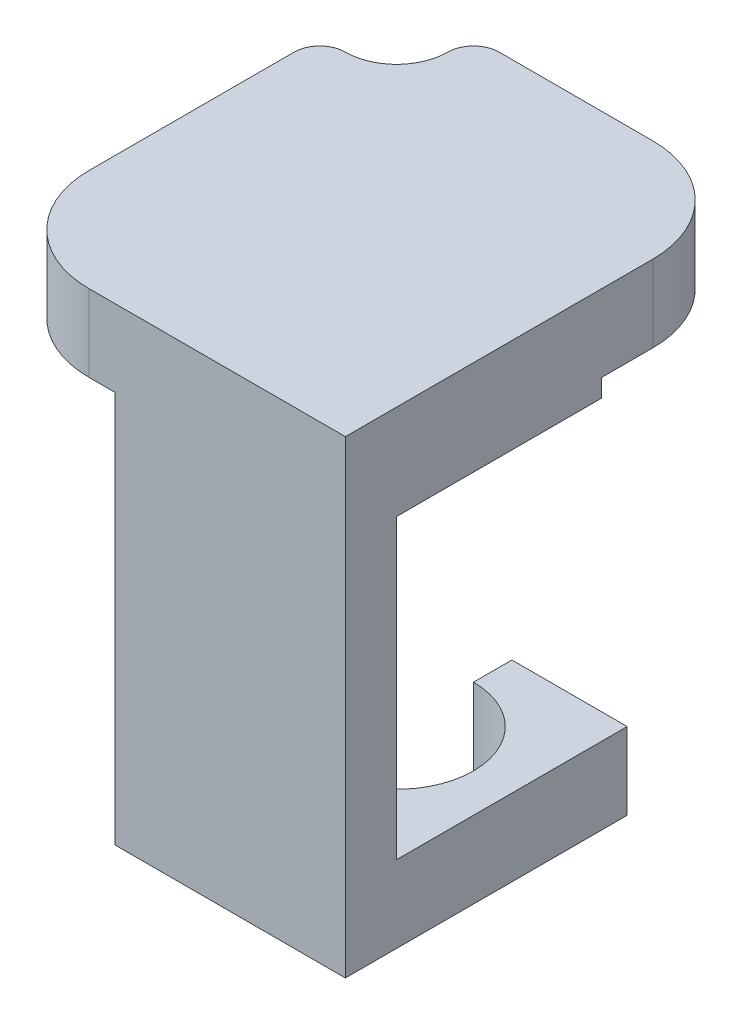
ISO-10303-21;
HEADER;
FILE_DESCRIPTION(('STEP AP214'),'2;1');
FILE_NAME('part.step','',(''),(''),'','','');
FILE_SCHEMA(('AUTOMOTIVE_DESIGN { 1 0 10303 214 1 1 1 1 }'));
ENDSEC;
DATA;
#1=APPLICATION_CONTEXT('core data for automotive mechanical design processes');
#2=APPLICATION_PROTOCOL_DEFINITION('international standard','automotive_design',2000,#1);
#3=PRODUCT_CONTEXT('',#1,'mechanical');
#4=PRODUCT('Part','Part','',(#3));
#5=PRODUCT_RELATED_PRODUCT_CATEGORY('part','',(#4));
#6=PRODUCT_DEFINITION_FORMATION('','',#4);
#7=PRODUCT_DEFINITION_CONTEXT('part definition',#1,'design');
#8=PRODUCT_DEFINITION('design','',#6,#7);
#9=PRODUCT_DEFINITION_SHAPE('','',#8);
#10=(LENGTH_UNIT() NAMED_UNIT(*) SI_UNIT(.MILLI.,.METRE.));
#11=(NAMED_UNIT(*) PLANE_ANGLE_UNIT() SI_UNIT($,.RADIAN.));
#12=(NAMED_UNIT(*) SI_UNIT($,.STERADIAN.) SOLID_ANGLE_UNIT());
#13=UNCERTAINTY_MEASURE_WITH_UNIT(LENGTH_MEASURE(1.E-05),#10,'distance_accuracy_value','');
#14=(GEOMETRIC_REPRESENTATION_CONTEXT(3) GLOBAL_UNCERTAINTY_ASSIGNED_CONTEXT((#13)) GLOBAL_UNIT_ASSIGNED_CONTEXT((#10,
#11,#12)) REPRESENTATION_CONTEXT('',''));
#15=CARTESIAN_POINT('',(0.,0.,0.));
#16=DIRECTION('',(0.,0.,1.));
#17=DIRECTION('',(1.,0.,0.));
#18=AXIS2_PLACEMENT_3D('',#15,#16,#17);
#19=CARTESIAN_POINT('',(0.,0.,-5.28410471378163));
#20=DIRECTION('',(0.,0.,-1.));
#21=DIRECTION('',(-1.,0.,0.));
#22=AXIS2_PLACEMENT_3D('',#19,#20,#21);
#23=PLANE('',#22);
#24=DIRECTION('',(0.,-1.,0.));
#25=VECTOR('',#24,1.);
#26=CARTESIAN_POINT('',(-13.3528439453228,-3.,-5.28410471378163));
#27=LINE('',#26,#25);
#28=CARTESIAN_POINT('',(-13.3528439453228,11.5999999999993,-5.28410471378163));
#29=VERTEX_POINT('',#28);
#30=CARTESIAN_POINT('',(-13.3528439453228,0.,-5.28410471378163));
#31=VERTEX_POINT('',#30);
#32=EDGE_CURVE('E243',#29,#31,#27,.T.);
#33=ORIENTED_EDGE('',*,*,#32,.F.);
#34=DIRECTION('',(-1.,0.,0.));
#35=VECTOR('',#34,1.);
#36=CARTESIAN_POINT('',(-4.35284394532278,11.5999999999993,-5.28410471378163));
#37=LINE('',#36,#35);
#38=CARTESIAN_POINT('',(-4.35284394532278,11.5999999999993,-5.28410471378163));
#39=VERTEX_POINT('',#38);
#40=EDGE_CURVE('E220',#39,#29,#37,.T.);
#41=ORIENTED_EDGE('',*,*,#40,.F.);
#42=DIRECTION('',(0.,1.,0.));
#43=VECTOR('',#42,1.);
#44=CARTESIAN_POINT('',(-4.35284394532278,-3.,-5.28410471378163));
#45=LINE('',#44,#43);
#46=CARTESIAN_POINT('',(-4.35284394532278,0.,-5.28410471378163));
#47=VERTEX_POINT('',#46);
#48=EDGE_CURVE('E247',#47,#39,#45,.T.);
#49=ORIENTED_EDGE('',*,*,#48,.F.);
#50=DIRECTION('',(1.,0.,0.));
#51=VECTOR('',#50,1.);
#52=CARTESIAN_POINT('',(-13.3528439453228,0.,-5.28410471378163));
#53=LINE('',#52,#51);
#54=EDGE_CURVE('E443',#31,#47,#53,.T.);
#55=ORIENTED_EDGE('',*,*,#54,.F.);
#56=EDGE_LOOP('',(#33,#41,#49,#55));
#57=FACE_BOUND('',#56,.T.);
#58=ADVANCED_FACE('F39',(#57),#23,.T.);
#59=CARTESIAN_POINT('',(-4.35284394532278,-3.,-14.2841047137816));
#60=DIRECTION('',(1.,0.,0.));
#61=DIRECTION('',(0.,0.,-1.));
#62=AXIS2_PLACEMENT_3D('',#59,#60,#61);
#63=PLANE('',#62);
#64=DIRECTION('',(0.,0.,-1.));
#65=VECTOR('',#64,1.);
#66=CARTESIAN_POINT('',(-4.35284394532278,12.3,-19.2841047137816));
#67=LINE('',#66,#65);
#68=CARTESIAN_POINT('',(-4.35284394532278,12.3,-13.2841047137816));
#69=VERTEX_POINT('',#68);
#70=CARTESIAN_POINT('',(-4.35284394532278,12.3,-15.2841047137816));
#71=VERTEX_POINT('',#70);
#72=EDGE_CURVE('E531',#69,#71,#67,.T.);
#73=ORIENTED_EDGE('',*,*,#72,.T.);
#74=DIRECTION('',(0.,1.,0.));
#75=VECTOR('',#74,1.);
#76=CARTESIAN_POINT('',(-4.35284394532278,-3.,-15.2841047137816));
#77=LINE('',#76,#75);
#78=CARTESIAN_POINT('',(-4.35284394532278,15.3,-15.2841047137816));
#79=VERTEX_POINT('',#78);
#80=EDGE_CURVE('E267',#71,#79,#77,.T.);
#81=ORIENTED_EDGE('',*,*,#80,.T.);
#82=DIRECTION('',(0.,0.,-1.));
#83=VECTOR('',#82,1.);
#84=CARTESIAN_POINT('',(-4.35284394532278,15.3,-3.28410471378163));
#85=LINE('',#84,#83);
#86=CARTESIAN_POINT('',(-4.35284394532278,15.3,-3.28410471378163));
#87=VERTEX_POINT('',#86);
#88=EDGE_CURVE('E255',#87,#79,#85,.T.);
#89=ORIENTED_EDGE('',*,*,#88,.F.);
#90=DIRECTION('',(0.,1.,0.));
#91=VECTOR('',#90,1.);
#92=CARTESIAN_POINT('',(-4.35284394532278,-3.,-3.28410471378163));
#93=LINE('',#92,#91);
#94=CARTESIAN_POINT('',(-4.35284394532278,-3.,-3.28410471378163));
#95=VERTEX_POINT('',#94);
#96=EDGE_CURVE('E250',#95,#87,#93,.T.);
#97=ORIENTED_EDGE('',*,*,#96,.F.);
#98=DIRECTION('',(0.,0.,-1.));
#99=VECTOR('',#98,1.);
#100=CARTESIAN_POINT('',(-4.35284394532278,-3.,-14.2841047137816));
#101=LINE('',#100,#99);
#102=CARTESIAN_POINT('',(-4.35284394532278,-3.,-14.2841047137816));
#103=VERTEX_POINT('',#102);
#104=EDGE_CURVE('E489',#95,#103,#101,.T.);
#105=ORIENTED_EDGE('',*,*,#104,.T.);
#106=DIRECTION('',(0.,1.,0.));
#107=VECTOR('',#106,1.);
#108=CARTESIAN_POINT('',(-4.35284394532278,-3.,-14.2841047137816));
#109=LINE('',#108,#107);
#110=CARTESIAN_POINT('',(-4.35284394532278,0.,-14.2841047137816));
#111=VERTEX_POINT('',#110);
#112=EDGE_CURVE('E268',#103,#111,#109,.T.);
#113=ORIENTED_EDGE('',*,*,#112,.T.);
#114=DIRECTION('',(0.,0.,-1.));
#115=VECTOR('',#114,1.);
#116=CARTESIAN_POINT('',(-4.35284394532278,0.,-14.2841047137816));
#117=LINE('',#116,#115);
#118=EDGE_CURVE('E456',#47,#111,#117,.T.);
#119=ORIENTED_EDGE('',*,*,#118,.F.);
#120=ORIENTED_EDGE('',*,*,#48,.T.);
#121=DIRECTION('',(0.,0.,1.));
#122=VECTOR('',#121,1.);
#123=CARTESIAN_POINT('',(-4.35284394532278,11.5999999999993,-13.2841047137816));
#124=LINE('',#123,#122);
#125=CARTESIAN_POINT('',(-4.35284394532278,11.5999999999993,-13.2841047137816));
#126=VERTEX_POINT('',#125);
#127=EDGE_CURVE('E241',#126,#39,#124,.T.);
#128=ORIENTED_EDGE('',*,*,#127,.F.);
#129=DIRECTION('',(0.,-1.,0.));
#130=VECTOR('',#129,1.);
#131=CARTESIAN_POINT('',(-4.35284394532278,15.3,-13.2841047137816));
#132=LINE('',#131,#130);
#133=EDGE_CURVE('E230',#69,#126,#132,.T.);
#134=ORIENTED_EDGE('',*,*,#133,.F.);
#135=EDGE_LOOP('',(#73,#81,#89,#97,#105,#113,#119,#120,#128,#134));
#136=FACE_BOUND('',#135,.T.);
#137=ADVANCED_FACE('F340',(#136),#63,.T.);
#138=CARTESIAN_POINT('',(-13.3528439453228,-3.,-14.2841047137816));
#139=DIRECTION('',(-1.,0.,0.));
#140=DIRECTION('',(0.,0.,1.));
#141=AXIS2_PLACEMENT_3D('',#138,#139,#140);
#142=PLANE('',#141);
#143=DIRECTION('',(0.,0.,1.));
#144=VECTOR('',#143,1.);
#145=CARTESIAN_POINT('',(-13.3528439453228,12.3,-14.2841047137816));
#146=LINE('',#145,#144);
#147=CARTESIAN_POINT('',(-13.3528439453228,12.3,-13.2841047137816));
#148=VERTEX_POINT('',#147);
#149=CARTESIAN_POINT('',(-13.3528439453228,12.3,-3.28410471378163));
#150=VERTEX_POINT('',#149);
#151=EDGE_CURVE('E216',#148,#150,#146,.T.);
#152=ORIENTED_EDGE('',*,*,#151,.F.);
#153=DIRECTION('',(0.,-1.,0.));
#154=VECTOR('',#153,1.);
#155=CARTESIAN_POINT('',(-13.3528439453228,15.3,-13.2841047137816));
#156=LINE('',#155,#154);
#157=CARTESIAN_POINT('',(-13.3528439453228,11.5999999999993,-13.2841047137816));
#158=VERTEX_POINT('',#157);
#159=EDGE_CURVE('E235',#148,#158,#156,.T.);
#160=ORIENTED_EDGE('',*,*,#159,.T.);
#161=DIRECTION('',(0.,0.,1.));
#162=VECTOR('',#161,1.);
#163=CARTESIAN_POINT('',(-13.3528439453228,11.5999999999993,-13.2841047137816));
#164=LINE('',#163,#162);
#165=EDGE_CURVE('E237',#158,#29,#164,.T.);
#166=ORIENTED_EDGE('',*,*,#165,.T.);
#167=ORIENTED_EDGE('',*,*,#32,.T.);
#168=DIRECTION('',(0.,0.,1.));
#169=VECTOR('',#168,1.);
#170=CARTESIAN_POINT('',(-13.3528439453228,0.,-14.2841047137816));
#171=LINE('',#170,#169);
#172=CARTESIAN_POINT('',(-13.3528439453228,0.,-9.78410471378163));
#173=VERTEX_POINT('',#172);
#174=EDGE_CURVE('E448',#173,#31,#171,.T.);
#175=ORIENTED_EDGE('',*,*,#174,.F.);
#176=DIRECTION('',(0.,-1.,0.));
#177=VECTOR('',#176,1.);
#178=CARTESIAN_POINT('',(-13.3528439453228,0.,-9.78410471378163));
#179=LINE('',#178,#177);
#180=CARTESIAN_POINT('',(-13.3528439453228,-3.,-9.78410471378163));
#181=VERTEX_POINT('',#180);
#182=EDGE_CURVE('E486',#173,#181,#179,.T.);
#183=ORIENTED_EDGE('',*,*,#182,.T.);
#184=DIRECTION('',(0.,0.,1.));
#185=VECTOR('',#184,1.);
#186=CARTESIAN_POINT('',(-13.3528439453228,-3.,-14.2841047137816));
#187=LINE('',#186,#185);
#188=CARTESIAN_POINT('',(-13.3528439453228,-3.,-3.28410471378163));
#189=VERTEX_POINT('',#188);
#190=EDGE_CURVE('E496',#181,#189,#187,.T.);
#191=ORIENTED_EDGE('',*,*,#190,.T.);
#192=DIRECTION('',(0.,-1.,0.));
#193=VECTOR('',#192,1.);
#194=CARTESIAN_POINT('',(-13.3528439453228,-3.,-3.28410471378163));
#195=LINE('',#194,#193);
#196=EDGE_CURVE('E244',#150,#189,#195,.T.);
#197=ORIENTED_EDGE('',*,*,#196,.F.);
#198=EDGE_LOOP('',(#152,#160,#166,#167,#175,#183,#191,#197));
#199=FACE_BOUND('',#198,.T.);
#200=ADVANCED_FACE('F346',(#199),#142,.T.);
#201=CARTESIAN_POINT('',(-13.3528439453228,-3.,-14.2841047137816));
#202=DIRECTION('',(0.,0.,-1.));
#203=DIRECTION('',(-1.,0.,0.));
#204=AXIS2_PLACEMENT_3D('',#201,#202,#203);
#205=PLANE('',#204);
#206=DIRECTION('',(0.,-1.,0.));
#207=VECTOR('',#206,1.);
#208=CARTESIAN_POINT('',(-8.85284394532278,0.,-14.2841047137816));
#209=LINE('',#208,#207);
#210=CARTESIAN_POINT('',(-8.85284394532278,0.,-14.2841047137816));
#211=VERTEX_POINT('',#210);
#212=CARTESIAN_POINT('',(-8.85284394532278,-3.,-14.2841047137816));
#213=VERTEX_POINT('',#212);
#214=EDGE_CURVE('E483',#211,#213,#209,.T.);
#215=ORIENTED_EDGE('',*,*,#214,.F.);
#216=DIRECTION('',(-1.,0.,0.));
#217=VECTOR('',#216,1.);
#218=CARTESIAN_POINT('',(-13.3528439453228,0.,-14.2841047137816));
#219=LINE('',#218,#217);
#220=EDGE_CURVE('E499',#111,#211,#219,.T.);
#221=ORIENTED_EDGE('',*,*,#220,.F.);
#222=ORIENTED_EDGE('',*,*,#112,.F.);
#223=DIRECTION('',(-1.,0.,0.));
#224=VECTOR('',#223,1.);
#225=CARTESIAN_POINT('',(-13.3528439453228,-3.,-14.2841047137816));
#226=LINE('',#225,#224);
#227=EDGE_CURVE('E492',#103,#213,#226,.T.);
#228=ORIENTED_EDGE('',*,*,#227,.T.);
#229=EDGE_LOOP('',(#215,#221,#222,#228));
#230=FACE_BOUND('',#229,.T.);
#231=ADVANCED_FACE('F372',(#230),#205,.T.);
#232=CARTESIAN_POINT('',(0.,-3.,0.));
#233=DIRECTION('',(0.,1.,0.));
#234=DIRECTION('',(0.,0.,1.));
#235=AXIS2_PLACEMENT_3D('',#232,#233,#234);
#236=PLANE('',#235);
#237=CARTESIAN_POINT('',(-8.85284394532278,-3.,-9.78410471378163));
#238=DIRECTION('',(0.,-1.,0.));
#239=DIRECTION('',(0.,0.,-1.));
#240=AXIS2_PLACEMENT_3D('',#237,#238,#239);
#241=CIRCLE('',#240,3.);
#242=CARTESIAN_POINT('',(-8.85284394532278,-3.,-12.7841047137816));
#243=VERTEX_POINT('',#242);
#244=CARTESIAN_POINT('',(-11.8528439453228,-3.,-9.78410471378163));
#245=VERTEX_POINT('',#244);
#246=EDGE_CURVE('E471',#243,#245,#241,.T.);
#247=ORIENTED_EDGE('',*,*,#246,.F.);
#248=DIRECTION('',(0.,0.,1.));
#249=VECTOR('',#248,1.);
#250=CARTESIAN_POINT('',(-8.85284394532278,-3.,-12.7841047137816));
#251=LINE('',#250,#249);
#252=EDGE_CURVE('E463',#213,#243,#251,.T.);
#253=ORIENTED_EDGE('',*,*,#252,.F.);
#254=ORIENTED_EDGE('',*,*,#227,.F.);
#255=ORIENTED_EDGE('',*,*,#104,.F.);
#256=DIRECTION('',(1.,0.,0.));
#257=VECTOR('',#256,1.);
#258=CARTESIAN_POINT('',(-13.3528439453228,-3.,-3.28410471378163));
#259=LINE('',#258,#257);
#260=EDGE_CURVE('E246',#189,#95,#259,.T.);
#261=ORIENTED_EDGE('',*,*,#260,.F.);
#262=ORIENTED_EDGE('',*,*,#190,.F.);
#263=DIRECTION('',(-1.,0.,0.));
#264=VECTOR('',#263,1.);
#265=CARTESIAN_POINT('',(-13.3528439453228,-3.,-9.78410471378163));
#266=LINE('',#265,#264);
#267=EDGE_CURVE('E475',#245,#181,#266,.T.);
#268=ORIENTED_EDGE('',*,*,#267,.F.);
#269=EDGE_LOOP('',(#247,#253,#254,#255,#261,#262,#268));
#270=FACE_BOUND('',#269,.T.);
#271=ADVANCED_FACE('F369',(#270),#236,.F.);
#272=CARTESIAN_POINT('',(0.,0.,0.));
#273=DIRECTION('',(0.,1.,0.));
#274=DIRECTION('',(0.,0.,1.));
#275=AXIS2_PLACEMENT_3D('',#272,#273,#274);
#276=PLANE('',#275);
#277=DIRECTION('',(0.,0.,1.));
#278=VECTOR('',#277,1.);
#279=CARTESIAN_POINT('',(-8.85284394532278,0.,-12.7841047137816));
#280=LINE('',#279,#278);
#281=CARTESIAN_POINT('',(-8.85284394532278,0.,-12.7841047137816));
#282=VERTEX_POINT('',#281);
#283=EDGE_CURVE('E466',#211,#282,#280,.T.);
#284=ORIENTED_EDGE('',*,*,#283,.T.);
#285=CARTESIAN_POINT('',(-8.85284394532278,0.,-9.78410471378163));
#286=DIRECTION('',(0.,-1.,0.));
#287=DIRECTION('',(0.,0.,-1.));
#288=AXIS2_PLACEMENT_3D('',#285,#286,#287);
#289=CIRCLE('',#288,3.);
#290=CARTESIAN_POINT('',(-11.8528439453228,0.,-9.78410471378163));
#291=VERTEX_POINT('',#290);
#292=EDGE_CURVE('E459',#282,#291,#289,.T.);
#293=ORIENTED_EDGE('',*,*,#292,.T.);
#294=DIRECTION('',(-1.,0.,0.));
#295=VECTOR('',#294,1.);
#296=CARTESIAN_POINT('',(-13.3528439453228,0.,-9.78410471378163));
#297=LINE('',#296,#295);
#298=EDGE_CURVE('E462',#291,#173,#297,.T.);
#299=ORIENTED_EDGE('',*,*,#298,.T.);
#300=ORIENTED_EDGE('',*,*,#174,.T.);
#301=ORIENTED_EDGE('',*,*,#54,.T.);
#302=ORIENTED_EDGE('',*,*,#118,.T.);
#303=ORIENTED_EDGE('',*,*,#220,.T.);
#304=EDGE_LOOP('',(#284,#293,#299,#300,#301,#302,#303));
#305=FACE_BOUND('',#304,.T.);
#306=ADVANCED_FACE('F367',(#305),#276,.T.);
#307=CARTESIAN_POINT('',(-8.85284394532278,0.,-9.78410471378163));
#308=DIRECTION('',(0.,-1.,0.));
#309=DIRECTION('',(0.,0.,-1.));
#310=AXIS2_PLACEMENT_3D('',#307,#308,#309);
#311=CYLINDRICAL_SURFACE('',#310,3.);
#312=ORIENTED_EDGE('',*,*,#246,.T.);
#313=DIRECTION('',(0.,-1.,0.));
#314=VECTOR('',#313,1.);
#315=CARTESIAN_POINT('',(-11.8528439453228,0.,-9.78410471378163));
#316=LINE('',#315,#314);
#317=EDGE_CURVE('E470',#291,#245,#316,.T.);
#318=ORIENTED_EDGE('',*,*,#317,.F.);
#319=ORIENTED_EDGE('',*,*,#292,.F.);
#320=DIRECTION('',(0.,-1.,0.));
#321=VECTOR('',#320,1.);
#322=CARTESIAN_POINT('',(-8.85284394532278,0.,-12.7841047137816));
#323=LINE('',#322,#321);
#324=EDGE_CURVE('E480',#282,#243,#323,.T.);
#325=ORIENTED_EDGE('',*,*,#324,.T.);
#326=EDGE_LOOP('',(#312,#318,#319,#325));
#327=FACE_BOUND('',#326,.T.);
#328=ADVANCED_FACE('F360',(#327),#311,.F.);
#329=CARTESIAN_POINT('',(-8.85284394532278,0.,-12.7841047137816));
#330=DIRECTION('',(1.,0.,0.));
#331=DIRECTION('',(0.,0.,-1.));
#332=AXIS2_PLACEMENT_3D('',#329,#330,#331);
#333=PLANE('',#332);
#334=ORIENTED_EDGE('',*,*,#252,.T.);
#335=ORIENTED_EDGE('',*,*,#324,.F.);
#336=ORIENTED_EDGE('',*,*,#283,.F.);
#337=ORIENTED_EDGE('',*,*,#214,.T.);
#338=EDGE_LOOP('',(#334,#335,#336,#337));
#339=FACE_BOUND('',#338,.T.);
#340=ADVANCED_FACE('F357',(#339),#333,.F.);
#341=CARTESIAN_POINT('',(-13.3528439453228,0.,-9.78410471378163));
#342=DIRECTION('',(0.,0.,1.));
#343=DIRECTION('',(1.,0.,0.));
#344=AXIS2_PLACEMENT_3D('',#341,#342,#343);
#345=PLANE('',#344);
#346=ORIENTED_EDGE('',*,*,#267,.T.);
#347=ORIENTED_EDGE('',*,*,#182,.F.);
#348=ORIENTED_EDGE('',*,*,#298,.F.);
#349=ORIENTED_EDGE('',*,*,#317,.T.);
#350=EDGE_LOOP('',(#346,#347,#348,#349));
#351=FACE_BOUND('',#350,.T.);
#352=ADVANCED_FACE('F356',(#351),#345,.F.);
#353=CARTESIAN_POINT('',(-13.3528439453228,15.3,-3.28410471378163));
#354=DIRECTION('',(0.,-1.,0.));
#355=DIRECTION('',(0.,0.,-1.));
#356=AXIS2_PLACEMENT_3D('',#353,#354,#355);
#357=PLANE('',#356);
#358=DIRECTION('',(-1.,0.,0.));
#359=VECTOR('',#358,1.);
#360=CARTESIAN_POINT('',(-13.3528439453207,15.3,-19.2841047137816));
#361=LINE('',#360,#359);
#362=CARTESIAN_POINT('',(-8.35284394532278,15.3,-19.2841047137816));
#363=VERTEX_POINT('',#362);
#364=CARTESIAN_POINT('',(-14.3528439453207,15.3,-19.2841047137816));
#365=VERTEX_POINT('',#364);
#366=EDGE_CURVE('E225',#363,#365,#361,.T.);
#367=ORIENTED_EDGE('',*,*,#366,.T.);
#368=CARTESIAN_POINT('',(-14.3528439453207,15.3,-18.2841047137816));
#369=DIRECTION('',(0.,-1.,0.));
#370=DIRECTION('',(0.,0.,-1.));
#371=AXIS2_PLACEMENT_3D('',#368,#369,#370);
#372=CIRCLE('',#371,1.);
#373=CARTESIAN_POINT('',(-15.3528439453207,15.3,-18.2841047137844));
#374=VERTEX_POINT('',#373);
#375=EDGE_CURVE('E307',#365,#374,#372,.F.);
#376=ORIENTED_EDGE('',*,*,#375,.T.);
#377=CARTESIAN_POINT('',(-17.3528439453207,15.3,-18.2841047137844));
#378=DIRECTION('',(0.,-1.,0.));
#379=DIRECTION('',(0.,0.,-1.));
#380=AXIS2_PLACEMENT_3D('',#377,#378,#379);
#381=CIRCLE('',#380,2.);
#382=CARTESIAN_POINT('',(-17.3528439453207,15.3,-16.2841047137844));
#383=VERTEX_POINT('',#382);
#384=EDGE_CURVE('E296',#374,#383,#381,.T.);
#385=ORIENTED_EDGE('',*,*,#384,.T.);
#386=CARTESIAN_POINT('',(-17.3528439453228,15.3,-15.2841047137844));
#387=DIRECTION('',(0.,-1.,0.));
#388=DIRECTION('',(0.,0.,-1.));
#389=AXIS2_PLACEMENT_3D('',#386,#387,#388);
#390=CIRCLE('',#389,1.);
#391=CARTESIAN_POINT('',(-18.3528439453228,15.3,-15.2841047137844));
#392=VERTEX_POINT('',#391);
#393=EDGE_CURVE('E60',#383,#392,#390,.F.);
#394=ORIENTED_EDGE('',*,*,#393,.T.);
#395=DIRECTION('',(0.,0.,1.));
#396=VECTOR('',#395,1.);
#397=CARTESIAN_POINT('',(-18.3528439453228,15.3,-3.28410471378163));
#398=LINE('',#397,#396);
#399=CARTESIAN_POINT('',(-18.3528439453228,15.3,-7.28410471378163));
#400=VERTEX_POINT('',#399);
#401=EDGE_CURVE('E210',#392,#400,#398,.T.);
#402=ORIENTED_EDGE('',*,*,#401,.T.);
#403=CARTESIAN_POINT('',(-14.3528439453228,15.3,-7.28410471378163));
#404=DIRECTION('',(0.,-1.,0.));
#405=DIRECTION('',(0.,0.,-1.));
#406=AXIS2_PLACEMENT_3D('',#403,#404,#405);
#407=CIRCLE('',#406,4.);
#408=CARTESIAN_POINT('',(-14.3528439453228,15.3,-3.28410471378163));
#409=VERTEX_POINT('',#408);
#410=EDGE_CURVE('E272',#400,#409,#407,.F.);
#411=ORIENTED_EDGE('',*,*,#410,.T.);
#412=DIRECTION('',(-1.,0.,0.));
#413=VECTOR('',#412,1.);
#414=CARTESIAN_POINT('',(-13.3528439453228,15.3,-3.28410471378163));
#415=LINE('',#414,#413);
#416=EDGE_CURVE('E252',#87,#409,#415,.T.);
#417=ORIENTED_EDGE('',*,*,#416,.F.);
#418=ORIENTED_EDGE('',*,*,#88,.T.);
#419=CARTESIAN_POINT('',(-8.35284394532278,15.3,-15.2841047137816));
#420=DIRECTION('',(0.,-1.,0.));
#421=DIRECTION('',(0.,0.,-1.));
#422=AXIS2_PLACEMENT_3D('',#419,#420,#421);
#423=CIRCLE('',#422,4.);
#424=EDGE_CURVE('E274',#79,#363,#423,.F.);
#425=ORIENTED_EDGE('',*,*,#424,.T.);
#426=EDGE_LOOP('',(#367,#376,#385,#394,#402,#411,#417,#418,#425));
#427=FACE_BOUND('',#426,.T.);
#428=ADVANCED_FACE('F329',(#427),#357,.F.);
#429=CARTESIAN_POINT('',(0.,0.,-3.28410471378163));
#430=DIRECTION('',(0.,0.,-1.));
#431=DIRECTION('',(-1.,0.,0.));
#432=AXIS2_PLACEMENT_3D('',#429,#430,#431);
#433=PLANE('',#432);
#434=ORIENTED_EDGE('',*,*,#416,.T.);
#435=DIRECTION('',(0.,1.,0.));
#436=VECTOR('',#435,1.);
#437=CARTESIAN_POINT('',(-14.3528439453228,12.3,-3.28410471378163));
#438=LINE('',#437,#436);
#439=CARTESIAN_POINT('',(-14.3528439453228,12.3,-3.28410471378163));
#440=VERTEX_POINT('',#439);
#441=EDGE_CURVE('E286',#409,#440,#438,.F.);
#442=ORIENTED_EDGE('',*,*,#441,.T.);
#443=DIRECTION('',(1.,0.,0.));
#444=VECTOR('',#443,1.);
#445=CARTESIAN_POINT('',(-18.3528439453228,12.3,-3.28410471378163));
#446=LINE('',#445,#444);
#447=EDGE_CURVE('E529',#440,#150,#446,.T.);
#448=ORIENTED_EDGE('',*,*,#447,.T.);
#449=ORIENTED_EDGE('',*,*,#196,.T.);
#450=ORIENTED_EDGE('',*,*,#260,.T.);
#451=ORIENTED_EDGE('',*,*,#96,.T.);
#452=EDGE_LOOP('',(#434,#442,#448,#449,#450,#451));
#453=FACE_BOUND('',#452,.T.);
#454=ADVANCED_FACE('F352',(#453),#433,.F.);
#455=CARTESIAN_POINT('',(-4.35284394532278,11.5999999999993,-13.2841047137816));
#456=DIRECTION('',(0.,1.,0.));
#457=DIRECTION('',(0.,0.,1.));
#458=AXIS2_PLACEMENT_3D('',#455,#456,#457);
#459=PLANE('',#458);
#460=CARTESIAN_POINT('',(-8.85284394532278,11.5999999999993,-9.78410471378163));
#461=DIRECTION('',(0.,-1.,0.));
#462=DIRECTION('',(0.,0.,-1.));
#463=AXIS2_PLACEMENT_3D('',#460,#461,#462);
#464=CIRCLE('',#463,1.32996856805454);
#465=CARTESIAN_POINT('',(-8.85284394532278,11.5999999999993,-11.1140732818362));
#466=VERTEX_POINT('',#465);
#467=EDGE_CURVE('E435',#466,#466,#464,.T.);
#468=ORIENTED_EDGE('',*,*,#467,.F.);
#469=EDGE_LOOP('',(#468));
#470=FACE_BOUND('',#469,.T.);
#471=ORIENTED_EDGE('',*,*,#40,.T.);
#472=ORIENTED_EDGE('',*,*,#165,.F.);
#473=DIRECTION('',(-1.,0.,0.));
#474=VECTOR('',#473,1.);
#475=CARTESIAN_POINT('',(-4.35284394532278,11.5999999999993,-13.2841047137816));
#476=LINE('',#475,#474);
#477=EDGE_CURVE('E232',#126,#158,#476,.T.);
#478=ORIENTED_EDGE('',*,*,#477,.F.);
#479=ORIENTED_EDGE('',*,*,#127,.T.);
#480=EDGE_LOOP('',(#471,#472,#478,#479));
#481=FACE_BOUND('',#480,.T.);
#482=ADVANCED_FACE('F424',(#470,#481),#459,.F.);
#483=CARTESIAN_POINT('',(0.,0.,-13.2841047137816));
#484=DIRECTION('',(0.,0.,-1.));
#485=DIRECTION('',(-1.,0.,0.));
#486=AXIS2_PLACEMENT_3D('',#483,#484,#485);
#487=PLANE('',#486);
#488=DIRECTION('',(-1.,0.,0.));
#489=VECTOR('',#488,1.);
#490=CARTESIAN_POINT('',(0.,12.3,-13.2841047137816));
#491=LINE('',#490,#489);
#492=EDGE_CURVE('E265',#69,#148,#491,.T.);
#493=ORIENTED_EDGE('',*,*,#492,.F.);
#494=ORIENTED_EDGE('',*,*,#133,.T.);
#495=ORIENTED_EDGE('',*,*,#477,.T.);
#496=ORIENTED_EDGE('',*,*,#159,.F.);
#497=EDGE_LOOP('',(#493,#494,#495,#496));
#498=FACE_BOUND('',#497,.T.);
#499=ADVANCED_FACE('F422',(#498),#487,.T.);
#500=CARTESIAN_POINT('',(-18.3528439453228,12.3,-3.28410471378163));
#501=DIRECTION('',(-1.,0.,0.));
#502=DIRECTION('',(0.,0.,1.));
#503=AXIS2_PLACEMENT_3D('',#500,#501,#502);
#504=PLANE('',#503);
#505=ORIENTED_EDGE('',*,*,#401,.F.);
#506=DIRECTION('',(0.,1.,0.));
#507=VECTOR('',#506,1.);
#508=CARTESIAN_POINT('',(-18.3528439453228,12.3,-15.2841047137844));
#509=LINE('',#508,#507);
#510=CARTESIAN_POINT('',(-18.3528439453228,14.3,-15.2841047137844));
#511=VERTEX_POINT('',#510);
#512=EDGE_CURVE('E11',#392,#511,#509,.F.);
#513=ORIENTED_EDGE('',*,*,#512,.T.);
#514=DIRECTION('',(0.,0.,1.));
#515=VECTOR('',#514,1.);
#516=CARTESIAN_POINT('',(-18.3528439453228,14.3,-16.2841047137844));
#517=LINE('',#516,#515);
#518=CARTESIAN_POINT('',(-18.3528439453228,14.3,-14.2841047137844));
#519=VERTEX_POINT('',#518);
#520=EDGE_CURVE('E192',#511,#519,#517,.T.);
#521=ORIENTED_EDGE('',*,*,#520,.T.);
#522=DIRECTION('',(0.,1.,0.));
#523=VECTOR('',#522,1.);
#524=CARTESIAN_POINT('',(-18.3528439453228,12.3,-14.2841047137844));
#525=LINE('',#524,#523);
#526=CARTESIAN_POINT('',(-18.3528439453228,12.3,-14.2841047137844));
#527=VERTEX_POINT('',#526);
#528=EDGE_CURVE('E197',#527,#519,#525,.T.);
#529=ORIENTED_EDGE('',*,*,#528,.F.);
#530=DIRECTION('',(0.,0.,1.));
#531=VECTOR('',#530,1.);
#532=CARTESIAN_POINT('',(-18.3528439453228,12.3,-3.28410471378163));
#533=LINE('',#532,#531);
#534=CARTESIAN_POINT('',(-18.3528439453228,12.3,-7.28410471378163));
#535=VERTEX_POINT('',#534);
#536=EDGE_CURVE('E528',#527,#535,#533,.T.);
#537=ORIENTED_EDGE('',*,*,#536,.T.);
#538=DIRECTION('',(0.,1.,0.));
#539=VECTOR('',#538,1.);
#540=CARTESIAN_POINT('',(-18.3528439453228,15.3,-7.28410471378163));
#541=LINE('',#540,#539);
#542=EDGE_CURVE('E283',#535,#400,#541,.T.);
#543=ORIENTED_EDGE('',*,*,#542,.T.);
#544=EDGE_LOOP('',(#505,#513,#521,#529,#537,#543));
#545=FACE_BOUND('',#544,.T.);
#546=ADVANCED_FACE('F194',(#545),#504,.T.);
#547=CARTESIAN_POINT('',(-18.3528439453228,12.3,-14.2841047137844));
#548=DIRECTION('',(0.,0.,-1.));
#549=DIRECTION('',(-1.,0.,0.));
#550=AXIS2_PLACEMENT_3D('',#547,#548,#549);
#551=PLANE('',#550);
#552=DIRECTION('',(-1.,0.,0.));
#553=VECTOR('',#552,1.);
#554=CARTESIAN_POINT('',(-18.3528439453228,14.3,-14.2841047137844));
#555=LINE('',#554,#553);
#556=CARTESIAN_POINT('',(-13.3528439453207,14.3,-14.2841047137844));
#557=VERTEX_POINT('',#556);
#558=EDGE_CURVE('E205',#557,#519,#555,.T.);
#559=ORIENTED_EDGE('',*,*,#558,.F.);
#560=DIRECTION('',(0.,1.,0.));
#561=VECTOR('',#560,1.);
#562=CARTESIAN_POINT('',(-13.3528439453207,12.3,-14.2841047137844));
#563=LINE('',#562,#561);
#564=CARTESIAN_POINT('',(-13.3528439453207,12.3,-14.2841047137844));
#565=VERTEX_POINT('',#564);
#566=EDGE_CURVE('E217',#565,#557,#563,.T.);
#567=ORIENTED_EDGE('',*,*,#566,.F.);
#568=DIRECTION('',(-1.,0.,0.));
#569=VECTOR('',#568,1.);
#570=CARTESIAN_POINT('',(-18.3528439453228,12.3,-14.2841047137844));
#571=LINE('',#570,#569);
#572=EDGE_CURVE('E215',#565,#527,#571,.T.);
#573=ORIENTED_EDGE('',*,*,#572,.T.);
#574=ORIENTED_EDGE('',*,*,#528,.T.);
#575=EDGE_LOOP('',(#559,#567,#573,#574));
#576=FACE_BOUND('',#575,.T.);
#577=ADVANCED_FACE('F213',(#576),#551,.T.);
#578=CARTESIAN_POINT('',(-13.3528439453207,12.3,-14.2841047137844));
#579=DIRECTION('',(-1.,0.,0.));
#580=DIRECTION('',(0.,0.,1.));
#581=AXIS2_PLACEMENT_3D('',#578,#579,#580);
#582=PLANE('',#581);
#583=DIRECTION('',(0.,0.,1.));
#584=VECTOR('',#583,1.);
#585=CARTESIAN_POINT('',(-13.3528439453207,14.3,-14.2841047137844));
#586=LINE('',#585,#584);
#587=CARTESIAN_POINT('',(-13.3528439453207,14.3,-19.2841047137816));
#588=VERTEX_POINT('',#587);
#589=EDGE_CURVE('E201',#588,#557,#586,.T.);
#590=ORIENTED_EDGE('',*,*,#589,.F.);
#591=DIRECTION('',(0.,1.,0.));
#592=VECTOR('',#591,1.);
#593=CARTESIAN_POINT('',(-13.3528439453207,12.3,-19.2841047137816));
#594=LINE('',#593,#592);
#595=CARTESIAN_POINT('',(-13.3528439453207,12.3,-19.2841047137816));
#596=VERTEX_POINT('',#595);
#597=EDGE_CURVE('E222',#596,#588,#594,.T.);
#598=ORIENTED_EDGE('',*,*,#597,.F.);
#599=DIRECTION('',(0.,0.,1.));
#600=VECTOR('',#599,1.);
#601=CARTESIAN_POINT('',(-13.3528439453207,12.3,-14.2841047137844));
#602=LINE('',#601,#600);
#603=EDGE_CURVE('E539',#596,#565,#602,.T.);
#604=ORIENTED_EDGE('',*,*,#603,.T.);
#605=ORIENTED_EDGE('',*,*,#566,.T.);
#606=EDGE_LOOP('',(#590,#598,#604,#605));
#607=FACE_BOUND('',#606,.T.);
#608=ADVANCED_FACE('F414',(#607),#582,.T.);
#609=CARTESIAN_POINT('',(-13.3528439453207,12.3,-19.2841047137816));
#610=DIRECTION('',(0.,0.,-1.));
#611=DIRECTION('',(-1.,0.,0.));
#612=AXIS2_PLACEMENT_3D('',#609,#610,#611);
#613=PLANE('',#612);
#614=DIRECTION('',(-1.,0.,0.));
#615=VECTOR('',#614,1.);
#616=CARTESIAN_POINT('',(-4.35284394532278,14.3,-19.2841047137816));
#617=LINE('',#616,#615);
#618=CARTESIAN_POINT('',(-14.3528439453207,14.3,-19.2841047137816));
#619=VERTEX_POINT('',#618);
#620=EDGE_CURVE('E202',#588,#619,#617,.T.);
#621=ORIENTED_EDGE('',*,*,#620,.T.);
#622=DIRECTION('',(0.,1.,0.));
#623=VECTOR('',#622,1.);
#624=CARTESIAN_POINT('',(-14.3528439453207,12.3,-19.2841047137816));
#625=LINE('',#624,#623);
#626=EDGE_CURVE('E302',#619,#365,#625,.T.);
#627=ORIENTED_EDGE('',*,*,#626,.T.);
#628=ORIENTED_EDGE('',*,*,#366,.F.);
#629=DIRECTION('',(0.,1.,0.));
#630=VECTOR('',#629,1.);
#631=CARTESIAN_POINT('',(-8.35284394532278,12.3,-19.2841047137816));
#632=LINE('',#631,#630);
#633=CARTESIAN_POINT('',(-8.35284394532278,12.3,-19.2841047137816));
#634=VERTEX_POINT('',#633);
#635=EDGE_CURVE('E277',#363,#634,#632,.F.);
#636=ORIENTED_EDGE('',*,*,#635,.T.);
#637=DIRECTION('',(-1.,0.,0.));
#638=VECTOR('',#637,1.);
#639=CARTESIAN_POINT('',(-13.3528439453207,12.3,-19.2841047137816));
#640=LINE('',#639,#638);
#641=EDGE_CURVE('E537',#634,#596,#640,.T.);
#642=ORIENTED_EDGE('',*,*,#641,.T.);
#643=ORIENTED_EDGE('',*,*,#597,.T.);
#644=EDGE_LOOP('',(#621,#627,#628,#636,#642,#643));
#645=FACE_BOUND('',#644,.T.);
#646=ADVANCED_FACE('F320',(#645),#613,.T.);
#647=CARTESIAN_POINT('',(0.,12.3,0.));
#648=DIRECTION('',(0.,-1.,0.));
#649=DIRECTION('',(0.,0.,-1.));
#650=AXIS2_PLACEMENT_3D('',#647,#648,#649);
#651=PLANE('',#650);
#652=ORIENTED_EDGE('',*,*,#641,.F.);
#653=CARTESIAN_POINT('',(-8.35284394532278,12.3,-15.2841047137816));
#654=DIRECTION('',(0.,-1.,0.));
#655=DIRECTION('',(0.,0.,-1.));
#656=AXIS2_PLACEMENT_3D('',#653,#654,#655);
#657=CIRCLE('',#656,4.);
#658=EDGE_CURVE('E281',#634,#71,#657,.T.);
#659=ORIENTED_EDGE('',*,*,#658,.T.);
#660=ORIENTED_EDGE('',*,*,#72,.F.);
#661=ORIENTED_EDGE('',*,*,#492,.T.);
#662=ORIENTED_EDGE('',*,*,#151,.T.);
#663=ORIENTED_EDGE('',*,*,#447,.F.);
#664=CARTESIAN_POINT('',(-14.3528439453228,12.3,-7.28410471378163));
#665=DIRECTION('',(0.,-1.,0.));
#666=DIRECTION('',(0.,0.,-1.));
#667=AXIS2_PLACEMENT_3D('',#664,#665,#666);
#668=CIRCLE('',#667,4.);
#669=EDGE_CURVE('E279',#440,#535,#668,.T.);
#670=ORIENTED_EDGE('',*,*,#669,.T.);
#671=ORIENTED_EDGE('',*,*,#536,.F.);
#672=ORIENTED_EDGE('',*,*,#572,.F.);
#673=ORIENTED_EDGE('',*,*,#603,.F.);
#674=EDGE_LOOP('',(#652,#659,#660,#661,#662,#663,#670,#671,#672,#673));
#675=FACE_BOUND('',#674,.T.);
#676=ADVANCED_FACE('F408',(#675),#651,.T.);
#677=CARTESIAN_POINT('',(282.252432083697,14.3,-121.270951477424));
#678=DIRECTION('',(0.,-1.,0.));
#679=DIRECTION('',(0.,0.,-1.));
#680=AXIS2_PLACEMENT_3D('',#677,#678,#679);
#681=PLANE('',#680);
#682=CARTESIAN_POINT('',(-17.3528439453207,14.3,-18.2841047137844));
#683=DIRECTION('',(0.,-1.,0.));
#684=DIRECTION('',(0.,0.,-1.));
#685=AXIS2_PLACEMENT_3D('',#682,#683,#684);
#686=CIRCLE('',#685,2.);
#687=CARTESIAN_POINT('',(-17.3528439453207,14.3,-16.2841047137844));
#688=VERTEX_POINT('',#687);
#689=CARTESIAN_POINT('',(-15.3528439453207,14.3,-18.2841047137844));
#690=VERTEX_POINT('',#689);
#691=EDGE_CURVE('E299',#688,#690,#686,.F.);
#692=ORIENTED_EDGE('',*,*,#691,.T.);
#693=CARTESIAN_POINT('',(-14.3528439453207,14.3,-18.2841047137816));
#694=DIRECTION('',(0.,-1.,0.));
#695=DIRECTION('',(0.,0.,-1.));
#696=AXIS2_PLACEMENT_3D('',#693,#694,#695);
#697=CIRCLE('',#696,1.);
#698=EDGE_CURVE('E47',#690,#619,#697,.T.);
#699=ORIENTED_EDGE('',*,*,#698,.T.);
#700=ORIENTED_EDGE('',*,*,#620,.F.);
#701=ORIENTED_EDGE('',*,*,#589,.T.);
#702=ORIENTED_EDGE('',*,*,#558,.T.);
#703=ORIENTED_EDGE('',*,*,#520,.F.);
#704=CARTESIAN_POINT('',(-17.3528439453228,14.3,-15.2841047137844));
#705=DIRECTION('',(0.,-1.,0.));
#706=DIRECTION('',(0.,0.,-1.));
#707=AXIS2_PLACEMENT_3D('',#704,#705,#706);
#708=CIRCLE('',#707,1.);
#709=EDGE_CURVE('E310',#511,#688,#708,.T.);
#710=ORIENTED_EDGE('',*,*,#709,.T.);
#711=EDGE_LOOP('',(#692,#699,#700,#701,#702,#703,#710));
#712=FACE_BOUND('',#711,.T.);
#713=ADVANCED_FACE('F206',(#712),#681,.T.);
#714=CARTESIAN_POINT('',(-8.35284394532278,-3.,-15.2841047137816));
#715=DIRECTION('',(0.,1.,0.));
#716=DIRECTION('',(0.,0.,1.));
#717=AXIS2_PLACEMENT_3D('',#714,#715,#716);
#718=CYLINDRICAL_SURFACE('',#717,4.);
#719=ORIENTED_EDGE('',*,*,#658,.F.);
#720=ORIENTED_EDGE('',*,*,#635,.F.);
#721=ORIENTED_EDGE('',*,*,#424,.F.);
#722=ORIENTED_EDGE('',*,*,#80,.F.);
#723=EDGE_LOOP('',(#719,#720,#721,#722));
#724=FACE_BOUND('',#723,.T.);
#725=ADVANCED_FACE('F383',(#724),#718,.T.);
#726=CARTESIAN_POINT('',(-14.3528439453228,12.3,-7.28410471378163));
#727=DIRECTION('',(0.,-1.,0.));
#728=DIRECTION('',(0.,0.,-1.));
#729=AXIS2_PLACEMENT_3D('',#726,#727,#728);
#730=CYLINDRICAL_SURFACE('',#729,4.);
#731=ORIENTED_EDGE('',*,*,#669,.F.);
#732=ORIENTED_EDGE('',*,*,#441,.F.);
#733=ORIENTED_EDGE('',*,*,#410,.F.);
#734=ORIENTED_EDGE('',*,*,#542,.F.);
#735=EDGE_LOOP('',(#731,#732,#733,#734));
#736=FACE_BOUND('',#735,.T.);
#737=ADVANCED_FACE('F386',(#736),#730,.T.);
#738=CARTESIAN_POINT('',(-17.3528439453207,-6.96029162546931,-18.2841047137844));
#739=DIRECTION('',(0.,-1.,0.));
#740=DIRECTION('',(0.,0.,-1.));
#741=AXIS2_PLACEMENT_3D('',#738,#739,#740);
#742=CYLINDRICAL_SURFACE('',#741,2.);
#743=ORIENTED_EDGE('',*,*,#691,.F.);
#744=DIRECTION('',(0.,1.,0.));
#745=VECTOR('',#744,1.);
#746=CARTESIAN_POINT('',(-17.3528439453207,14.3,-16.2841047137844));
#747=LINE('',#746,#745);
#748=EDGE_CURVE('E292',#383,#688,#747,.F.);
#749=ORIENTED_EDGE('',*,*,#748,.F.);
#750=ORIENTED_EDGE('',*,*,#384,.F.);
#751=DIRECTION('',(0.,1.,0.));
#752=VECTOR('',#751,1.);
#753=CARTESIAN_POINT('',(-15.3528439453207,15.3,-18.2841047137844));
#754=LINE('',#753,#752);
#755=EDGE_CURVE('E288',#690,#374,#754,.T.);
#756=ORIENTED_EDGE('',*,*,#755,.F.);
#757=EDGE_LOOP('',(#743,#749,#750,#756));
#758=FACE_BOUND('',#757,.T.);
#759=ADVANCED_FACE('F332',(#758),#742,.F.);
#760=CARTESIAN_POINT('',(-8.85284394532278,12.5999999999993,-9.78410471378163));
#761=DIRECTION('',(0.,-1.,0.));
#762=DIRECTION('',(0.,0.,-1.));
#763=AXIS2_PLACEMENT_3D('',#760,#761,#762);
#764=CYLINDRICAL_SURFACE('',#763,1.32996856805454);
#765=CARTESIAN_POINT('',(-8.85284394532278,12.5999999999993,-9.78410471378163));
#766=DIRECTION('',(0.,-1.,0.));
#767=DIRECTION('',(0.,0.,-1.));
#768=AXIS2_PLACEMENT_3D('',#765,#766,#767);
#769=CIRCLE('',#768,1.32996856805454);
#770=CARTESIAN_POINT('',(-8.85284394532278,12.5999999999993,-11.1140732818362));
#771=VERTEX_POINT('',#770);
#772=EDGE_CURVE('E325',#771,#771,#769,.T.);
#773=ORIENTED_EDGE('',*,*,#772,.F.);
#774=EDGE_LOOP('',(#773));
#775=FACE_BOUND('',#774,.T.);
#776=ORIENTED_EDGE('',*,*,#467,.T.);
#777=EDGE_LOOP('',(#776));
#778=FACE_BOUND('',#777,.T.);
#779=ADVANCED_FACE('F392',(#775,#778),#764,.F.);
#780=CARTESIAN_POINT('',(-8.85284394532278,12.5999999999993,-9.78410471378163));
#781=DIRECTION('',(0.,-1.,0.));
#782=DIRECTION('',(0.,0.,-1.));
#783=AXIS2_PLACEMENT_3D('',#780,#781,#782);
#784=PLANE('',#783);
#785=ORIENTED_EDGE('',*,*,#772,.T.);
#786=EDGE_LOOP('',(#785));
#787=FACE_BOUND('',#786,.T.);
#788=ADVANCED_FACE('F338',(#787),#784,.T.);
#789=CARTESIAN_POINT('',(-14.3528439453207,12.3,-18.2841047137816));
#790=DIRECTION('',(0.,1.,0.));
#791=DIRECTION('',(0.,0.,1.));
#792=AXIS2_PLACEMENT_3D('',#789,#790,#791);
#793=CYLINDRICAL_SURFACE('',#792,1.);
#794=ORIENTED_EDGE('',*,*,#698,.F.);
#795=ORIENTED_EDGE('',*,*,#755,.T.);
#796=ORIENTED_EDGE('',*,*,#375,.F.);
#797=ORIENTED_EDGE('',*,*,#626,.F.);
#798=EDGE_LOOP('',(#794,#795,#796,#797));
#799=FACE_BOUND('',#798,.T.);
#800=ADVANCED_FACE('F327',(#799),#793,.T.);
#801=CARTESIAN_POINT('',(-17.3528439453228,-6.96029162546931,-15.2841047137844));
#802=DIRECTION('',(0.,1.,0.));
#803=DIRECTION('',(0.,0.,1.));
#804=AXIS2_PLACEMENT_3D('',#801,#802,#803);
#805=CYLINDRICAL_SURFACE('',#804,1.);
#806=ORIENTED_EDGE('',*,*,#709,.F.);
#807=ORIENTED_EDGE('',*,*,#512,.F.);
#808=ORIENTED_EDGE('',*,*,#393,.F.);
#809=ORIENTED_EDGE('',*,*,#748,.T.);
#810=EDGE_LOOP('',(#806,#807,#808,#809));
#811=FACE_BOUND('',#810,.T.);
#812=ADVANCED_FACE('F41',(#811),#805,.T.);
#813=CLOSED_SHELL('',(#58,#137,#200,#231,#271,#306,#328,#340,#352,#428,#454,#482,#499,#546,#577,
#608,#646,#676,#713,#725,#737,#759,#779,#788,#800,#812));
#814=MANIFOLD_SOLID_BREP('B2',#813);
#815=ADVANCED_BREP_SHAPE_REPRESENTATION('',(#18,#814),#14);
#816=SHAPE_DEFINITION_REPRESENTATION(#9,#815);
ENDSEC;
END-ISO-10303-21;
